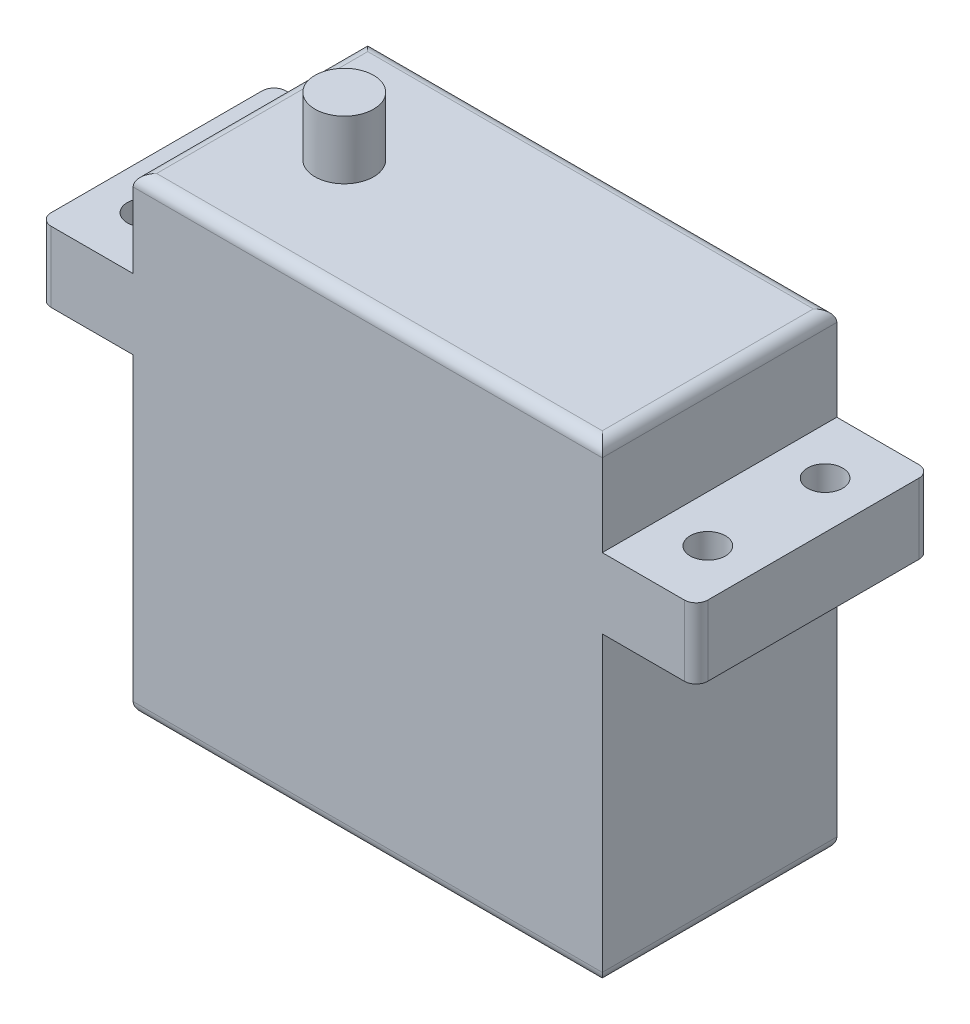
ISO-10303-21;
HEADER;
FILE_DESCRIPTION(('STEP AP214'),'2;1');
FILE_NAME('part.step','',(''),(''),'','','');
FILE_SCHEMA(('AUTOMOTIVE_DESIGN { 1 0 10303 214 1 1 1 1 }'));
ENDSEC;
DATA;
#1=APPLICATION_CONTEXT('core data for automotive mechanical design processes');
#2=APPLICATION_PROTOCOL_DEFINITION('international standard','automotive_design',2000,#1);
#3=PRODUCT_CONTEXT('',#1,'mechanical');
#4=PRODUCT('Part','Part','',(#3));
#5=PRODUCT_RELATED_PRODUCT_CATEGORY('part','',(#4));
#6=PRODUCT_DEFINITION_FORMATION('','',#4);
#7=PRODUCT_DEFINITION_CONTEXT('part definition',#1,'design');
#8=PRODUCT_DEFINITION('design','',#6,#7);
#9=PRODUCT_DEFINITION_SHAPE('','',#8);
#10=(LENGTH_UNIT() NAMED_UNIT(*) SI_UNIT(.MILLI.,.METRE.));
#11=(NAMED_UNIT(*) PLANE_ANGLE_UNIT() SI_UNIT($,.RADIAN.));
#12=(NAMED_UNIT(*) SI_UNIT($,.STERADIAN.) SOLID_ANGLE_UNIT());
#13=UNCERTAINTY_MEASURE_WITH_UNIT(LENGTH_MEASURE(1.E-05),#10,'distance_accuracy_value','');
#14=(GEOMETRIC_REPRESENTATION_CONTEXT(3) GLOBAL_UNCERTAINTY_ASSIGNED_CONTEXT((#13)) GLOBAL_UNIT_ASSIGNED_CONTEXT((#10,
#11,#12)) REPRESENTATION_CONTEXT('',''));
#15=CARTESIAN_POINT('',(0.,0.,0.));
#16=DIRECTION('',(0.,0.,1.));
#17=DIRECTION('',(1.,0.,0.));
#18=AXIS2_PLACEMENT_3D('',#15,#16,#17);
#19=CARTESIAN_POINT('',(-27.,0.,1.));
#20=DIRECTION('',(0.,-1.,0.));
#21=DIRECTION('',(1.,0.,0.));
#22=AXIS2_PLACEMENT_3D('',#19,#20,#21);
#23=CYLINDRICAL_SURFACE('',#22,1.);
#24=DIRECTION('',(0.,1.,0.));
#25=VECTOR('',#24,1.);
#26=CARTESIAN_POINT('',(-27.,0.,0.));
#27=LINE('',#26,#25);
#28=CARTESIAN_POINT('',(-27.,6.60422946958976,0.));
#29=VERTEX_POINT('',#28);
#30=CARTESIAN_POINT('',(-27.,12.6042294695898,0.));
#31=VERTEX_POINT('',#30);
#32=EDGE_CURVE('E324',#29,#31,#27,.T.);
#33=ORIENTED_EDGE('',*,*,#32,.F.);
#34=CARTESIAN_POINT('',(-27.,6.60422946958976,1.));
#35=DIRECTION('',(0.,1.,0.));
#36=DIRECTION('',(-1.,0.,0.));
#37=AXIS2_PLACEMENT_3D('',#34,#35,#36);
#38=CIRCLE('',#37,1.);
#39=CARTESIAN_POINT('',(-28.,6.60422946958976,1.));
#40=VERTEX_POINT('',#39);
#41=EDGE_CURVE('E330',#40,#29,#38,.F.);
#42=ORIENTED_EDGE('',*,*,#41,.F.);
#43=DIRECTION('',(0.,1.,0.));
#44=VECTOR('',#43,1.);
#45=CARTESIAN_POINT('',(-28.,0.,1.));
#46=LINE('',#45,#44);
#47=CARTESIAN_POINT('',(-28.,12.6042294695898,1.));
#48=VERTEX_POINT('',#47);
#49=EDGE_CURVE('E327',#48,#40,#46,.F.);
#50=ORIENTED_EDGE('',*,*,#49,.F.);
#51=CARTESIAN_POINT('',(-27.,12.6042294695898,1.));
#52=DIRECTION('',(0.,-1.,0.));
#53=DIRECTION('',(1.,0.,0.));
#54=AXIS2_PLACEMENT_3D('',#51,#52,#53);
#55=CIRCLE('',#54,1.);
#56=EDGE_CURVE('E332',#31,#48,#55,.F.);
#57=ORIENTED_EDGE('',*,*,#56,.F.);
#58=EDGE_LOOP('',(#33,#42,#50,#57));
#59=FACE_BOUND('',#58,.T.);
#60=ADVANCED_FACE('F42',(#59),#23,.T.);
#61=CARTESIAN_POINT('',(27.,0.,19.));
#62=DIRECTION('',(0.,-1.,0.));
#63=DIRECTION('',(0.,0.,-1.));
#64=AXIS2_PLACEMENT_3D('',#61,#62,#63);
#65=CYLINDRICAL_SURFACE('',#64,1.);
#66=DIRECTION('',(0.,-1.,0.));
#67=VECTOR('',#66,1.);
#68=CARTESIAN_POINT('',(28.,0.,19.));
#69=LINE('',#68,#67);
#70=CARTESIAN_POINT('',(28.,12.,19.));
#71=VERTEX_POINT('',#70);
#72=CARTESIAN_POINT('',(28.,6.,19.));
#73=VERTEX_POINT('',#72);
#74=EDGE_CURVE('E304',#71,#73,#69,.T.);
#75=ORIENTED_EDGE('',*,*,#74,.F.);
#76=CARTESIAN_POINT('',(27.,12.,19.));
#77=DIRECTION('',(0.,-1.,0.));
#78=DIRECTION('',(1.,0.,0.));
#79=AXIS2_PLACEMENT_3D('',#76,#77,#78);
#80=CIRCLE('',#79,1.);
#81=CARTESIAN_POINT('',(27.,12.,20.));
#82=VERTEX_POINT('',#81);
#83=EDGE_CURVE('E319',#82,#71,#80,.F.);
#84=ORIENTED_EDGE('',*,*,#83,.F.);
#85=DIRECTION('',(0.,-1.,0.));
#86=VECTOR('',#85,1.);
#87=CARTESIAN_POINT('',(27.,0.,20.));
#88=LINE('',#87,#86);
#89=CARTESIAN_POINT('',(27.,6.,20.));
#90=VERTEX_POINT('',#89);
#91=EDGE_CURVE('E316',#90,#82,#88,.F.);
#92=ORIENTED_EDGE('',*,*,#91,.F.);
#93=CARTESIAN_POINT('',(27.,6.,19.));
#94=DIRECTION('',(0.,1.,0.));
#95=DIRECTION('',(-1.,0.,0.));
#96=AXIS2_PLACEMENT_3D('',#93,#94,#95);
#97=CIRCLE('',#96,1.);
#98=EDGE_CURVE('E322',#73,#90,#97,.F.);
#99=ORIENTED_EDGE('',*,*,#98,.F.);
#100=EDGE_LOOP('',(#75,#84,#92,#99));
#101=FACE_BOUND('',#100,.T.);
#102=ADVANCED_FACE('F398',(#101),#65,.T.);
#103=CARTESIAN_POINT('',(-20.,20.,20.));
#104=DIRECTION('',(1.,0.,0.));
#105=DIRECTION('',(0.,1.,0.));
#106=AXIS2_PLACEMENT_3D('',#103,#104,#105);
#107=PLANE('',#106);
#108=DIRECTION('',(0.,-1.,0.));
#109=VECTOR('',#108,1.);
#110=CARTESIAN_POINT('',(-20.,20.,20.));
#111=LINE('',#110,#109);
#112=CARTESIAN_POINT('',(-20.,19.,20.));
#113=VERTEX_POINT('',#112);
#114=CARTESIAN_POINT('',(-20.,12.6042294695898,20.));
#115=VERTEX_POINT('',#114);
#116=EDGE_CURVE('E194',#113,#115,#111,.T.);
#117=ORIENTED_EDGE('',*,*,#116,.F.);
#118=DIRECTION('',(0.,0.,-1.));
#119=VECTOR('',#118,1.);
#120=CARTESIAN_POINT('',(-20.,19.,20.));
#121=LINE('',#120,#119);
#122=CARTESIAN_POINT('',(-20.,19.,0.));
#123=VERTEX_POINT('',#122);
#124=EDGE_CURVE('E270',#113,#123,#121,.T.);
#125=ORIENTED_EDGE('',*,*,#124,.T.);
#126=DIRECTION('',(0.,-1.,0.));
#127=VECTOR('',#126,1.);
#128=CARTESIAN_POINT('',(-20.,20.,0.));
#129=LINE('',#128,#127);
#130=CARTESIAN_POINT('',(-20.,12.6042294695898,0.));
#131=VERTEX_POINT('',#130);
#132=EDGE_CURVE('E245',#123,#131,#129,.T.);
#133=ORIENTED_EDGE('',*,*,#132,.T.);
#134=DIRECTION('',(0.,0.,-1.));
#135=VECTOR('',#134,1.);
#136=CARTESIAN_POINT('',(-20.,12.6042294695898,0.));
#137=LINE('',#136,#135);
#138=EDGE_CURVE('E199',#115,#131,#137,.T.);
#139=ORIENTED_EDGE('',*,*,#138,.F.);
#140=EDGE_LOOP('',(#117,#125,#133,#139));
#141=FACE_BOUND('',#140,.T.);
#142=ADVANCED_FACE('F404',(#141),#107,.F.);
#143=CARTESIAN_POINT('',(-20.,6.60422946958976,0.));
#144=VERTEX_POINT('',#143);
#145=CARTESIAN_POINT('',(-20.,-19.,0.));
#146=VERTEX_POINT('',#145);
#147=EDGE_CURVE('E244',#144,#146,#129,.T.);
#148=ORIENTED_EDGE('',*,*,#147,.T.);
#149=DIRECTION('',(0.,0.,-1.));
#150=VECTOR('',#149,1.);
#151=CARTESIAN_POINT('',(-20.,-19.,20.));
#152=LINE('',#151,#150);
#153=CARTESIAN_POINT('',(-20.,-19.,20.));
#154=VERTEX_POINT('',#153);
#155=EDGE_CURVE('E193',#146,#154,#152,.F.);
#156=ORIENTED_EDGE('',*,*,#155,.T.);
#157=CARTESIAN_POINT('',(-20.,6.60422946958976,20.));
#158=VERTEX_POINT('',#157);
#159=EDGE_CURVE('E178',#158,#154,#111,.T.);
#160=ORIENTED_EDGE('',*,*,#159,.F.);
#161=DIRECTION('',(0.,0.,1.));
#162=VECTOR('',#161,1.);
#163=CARTESIAN_POINT('',(-20.,6.60422946958976,0.));
#164=LINE('',#163,#162);
#165=EDGE_CURVE('E190',#144,#158,#164,.T.);
#166=ORIENTED_EDGE('',*,*,#165,.F.);
#167=EDGE_LOOP('',(#148,#156,#160,#166));
#168=FACE_BOUND('',#167,.T.);
#169=ADVANCED_FACE('F189',(#168),#107,.F.);
#170=CARTESIAN_POINT('',(20.,20.,20.));
#171=DIRECTION('',(-1.,0.,0.));
#172=DIRECTION('',(0.,-1.,0.));
#173=AXIS2_PLACEMENT_3D('',#170,#171,#172);
#174=PLANE('',#173);
#175=DIRECTION('',(0.,1.,0.));
#176=VECTOR('',#175,1.);
#177=CARTESIAN_POINT('',(20.,20.,0.));
#178=LINE('',#177,#176);
#179=CARTESIAN_POINT('',(20.,12.,0.));
#180=VERTEX_POINT('',#179);
#181=CARTESIAN_POINT('',(20.,19.,0.));
#182=VERTEX_POINT('',#181);
#183=EDGE_CURVE('E235',#180,#182,#178,.T.);
#184=ORIENTED_EDGE('',*,*,#183,.T.);
#185=DIRECTION('',(0.,0.,-1.));
#186=VECTOR('',#185,1.);
#187=CARTESIAN_POINT('',(20.,19.,20.));
#188=LINE('',#187,#186);
#189=CARTESIAN_POINT('',(20.,19.,20.));
#190=VERTEX_POINT('',#189);
#191=EDGE_CURVE('E267',#182,#190,#188,.F.);
#192=ORIENTED_EDGE('',*,*,#191,.T.);
#193=DIRECTION('',(0.,1.,0.));
#194=VECTOR('',#193,1.);
#195=CARTESIAN_POINT('',(20.,20.,20.));
#196=LINE('',#195,#194);
#197=CARTESIAN_POINT('',(20.,12.,20.));
#198=VERTEX_POINT('',#197);
#199=EDGE_CURVE('E237',#198,#190,#196,.T.);
#200=ORIENTED_EDGE('',*,*,#199,.F.);
#201=DIRECTION('',(0.,0.,1.));
#202=VECTOR('',#201,1.);
#203=CARTESIAN_POINT('',(20.,12.,20.));
#204=LINE('',#203,#202);
#205=EDGE_CURVE('E221',#180,#198,#204,.T.);
#206=ORIENTED_EDGE('',*,*,#205,.F.);
#207=EDGE_LOOP('',(#184,#192,#200,#206));
#208=FACE_BOUND('',#207,.T.);
#209=ADVANCED_FACE('F472',(#208),#174,.F.);
#210=CARTESIAN_POINT('',(20.,-19.,20.));
#211=VERTEX_POINT('',#210);
#212=CARTESIAN_POINT('',(20.,6.,20.));
#213=VERTEX_POINT('',#212);
#214=EDGE_CURVE('E195',#211,#213,#196,.T.);
#215=ORIENTED_EDGE('',*,*,#214,.F.);
#216=DIRECTION('',(0.,0.,-1.));
#217=VECTOR('',#216,1.);
#218=CARTESIAN_POINT('',(20.,-19.,20.));
#219=LINE('',#218,#217);
#220=CARTESIAN_POINT('',(20.,-19.,0.));
#221=VERTEX_POINT('',#220);
#222=EDGE_CURVE('E300',#211,#221,#219,.T.);
#223=ORIENTED_EDGE('',*,*,#222,.T.);
#224=CARTESIAN_POINT('',(20.,6.,0.));
#225=VERTEX_POINT('',#224);
#226=EDGE_CURVE('E241',#221,#225,#178,.T.);
#227=ORIENTED_EDGE('',*,*,#226,.T.);
#228=DIRECTION('',(0.,0.,-1.));
#229=VECTOR('',#228,1.);
#230=CARTESIAN_POINT('',(20.,6.,20.));
#231=LINE('',#230,#229);
#232=EDGE_CURVE('E216',#213,#225,#231,.T.);
#233=ORIENTED_EDGE('',*,*,#232,.F.);
#234=EDGE_LOOP('',(#215,#223,#227,#233));
#235=FACE_BOUND('',#234,.T.);
#236=ADVANCED_FACE('F436',(#235),#174,.F.);
#237=CARTESIAN_POINT('',(-20.,20.,20.));
#238=DIRECTION('',(0.,-1.,0.));
#239=DIRECTION('',(0.,0.,-1.));
#240=AXIS2_PLACEMENT_3D('',#237,#238,#239);
#241=PLANE('',#240);
#242=DIRECTION('',(0.,0.,-1.));
#243=VECTOR('',#242,1.);
#244=CARTESIAN_POINT('',(19.,20.,20.));
#245=LINE('',#244,#243);
#246=CARTESIAN_POINT('',(19.,20.,19.));
#247=VERTEX_POINT('',#246);
#248=CARTESIAN_POINT('',(19.,20.,1.));
#249=VERTEX_POINT('',#248);
#250=EDGE_CURVE('E262',#247,#249,#245,.T.);
#251=ORIENTED_EDGE('',*,*,#250,.T.);
#252=DIRECTION('',(-1.,0.,0.));
#253=VECTOR('',#252,1.);
#254=CARTESIAN_POINT('',(-20.,20.,1.));
#255=LINE('',#254,#253);
#256=CARTESIAN_POINT('',(-19.,20.,1.));
#257=VERTEX_POINT('',#256);
#258=EDGE_CURVE('E265',#249,#257,#255,.T.);
#259=ORIENTED_EDGE('',*,*,#258,.T.);
#260=DIRECTION('',(0.,0.,-1.));
#261=VECTOR('',#260,1.);
#262=CARTESIAN_POINT('',(-19.,20.,20.));
#263=LINE('',#262,#261);
#264=CARTESIAN_POINT('',(-19.,20.,19.));
#265=VERTEX_POINT('',#264);
#266=EDGE_CURVE('E260',#257,#265,#263,.F.);
#267=ORIENTED_EDGE('',*,*,#266,.T.);
#268=DIRECTION('',(-1.,0.,0.));
#269=VECTOR('',#268,1.);
#270=CARTESIAN_POINT('',(20.,20.,19.));
#271=LINE('',#270,#269);
#272=EDGE_CURVE('E250',#265,#247,#271,.F.);
#273=ORIENTED_EDGE('',*,*,#272,.T.);
#274=EDGE_LOOP('',(#251,#259,#267,#273));
#275=FACE_BOUND('',#274,.T.);
#276=CARTESIAN_POINT('',(-12.,20.,10.));
#277=DIRECTION('',(0.,-1.,0.));
#278=DIRECTION('',(0.,0.,-1.));
#279=AXIS2_PLACEMENT_3D('',#276,#277,#278);
#280=CIRCLE('',#279,2.5);
#281=CARTESIAN_POINT('',(-12.,20.,7.5));
#282=VERTEX_POINT('',#281);
#283=EDGE_CURVE('E240',#282,#282,#280,.F.);
#284=ORIENTED_EDGE('',*,*,#283,.F.);
#285=EDGE_LOOP('',(#284));
#286=FACE_BOUND('',#285,.T.);
#287=ADVANCED_FACE('F458',(#275,#286),#241,.F.);
#288=CARTESIAN_POINT('',(-20.,-20.,20.));
#289=DIRECTION('',(0.,1.,0.));
#290=DIRECTION('',(0.,0.,1.));
#291=AXIS2_PLACEMENT_3D('',#288,#289,#290);
#292=PLANE('',#291);
#293=DIRECTION('',(1.,0.,0.));
#294=VECTOR('',#293,1.);
#295=CARTESIAN_POINT('',(-20.,-20.,19.));
#296=LINE('',#295,#294);
#297=CARTESIAN_POINT('',(19.,-20.,19.));
#298=VERTEX_POINT('',#297);
#299=CARTESIAN_POINT('',(-19.,-20.,19.));
#300=VERTEX_POINT('',#299);
#301=EDGE_CURVE('E292',#298,#300,#296,.F.);
#302=ORIENTED_EDGE('',*,*,#301,.T.);
#303=DIRECTION('',(0.,0.,-1.));
#304=VECTOR('',#303,1.);
#305=CARTESIAN_POINT('',(-19.,-20.,20.));
#306=LINE('',#305,#304);
#307=CARTESIAN_POINT('',(-19.,-20.,1.));
#308=VERTEX_POINT('',#307);
#309=EDGE_CURVE('E294',#300,#308,#306,.T.);
#310=ORIENTED_EDGE('',*,*,#309,.T.);
#311=DIRECTION('',(1.,0.,0.));
#312=VECTOR('',#311,1.);
#313=CARTESIAN_POINT('',(-20.,-20.,1.));
#314=LINE('',#313,#312);
#315=CARTESIAN_POINT('',(19.,-20.,1.));
#316=VERTEX_POINT('',#315);
#317=EDGE_CURVE('E276',#308,#316,#314,.T.);
#318=ORIENTED_EDGE('',*,*,#317,.T.);
#319=DIRECTION('',(0.,0.,-1.));
#320=VECTOR('',#319,1.);
#321=CARTESIAN_POINT('',(19.,-20.,20.));
#322=LINE('',#321,#320);
#323=EDGE_CURVE('E290',#316,#298,#322,.F.);
#324=ORIENTED_EDGE('',*,*,#323,.T.);
#325=EDGE_LOOP('',(#302,#310,#318,#324));
#326=FACE_BOUND('',#325,.T.);
#327=ADVANCED_FACE('F456',(#326),#292,.F.);
#328=CARTESIAN_POINT('',(0.,0.,20.));
#329=DIRECTION('',(0.,0.,1.));
#330=DIRECTION('',(1.,0.,0.));
#331=AXIS2_PLACEMENT_3D('',#328,#329,#330);
#332=PLANE('',#331);
#333=DIRECTION('',(1.,0.,0.));
#334=VECTOR('',#333,1.);
#335=CARTESIAN_POINT('',(-28.,12.6042294695898,20.));
#336=LINE('',#335,#334);
#337=CARTESIAN_POINT('',(-27.,12.6042294695898,20.));
#338=VERTEX_POINT('',#337);
#339=EDGE_CURVE('E183',#338,#115,#336,.T.);
#340=ORIENTED_EDGE('',*,*,#339,.F.);
#341=DIRECTION('',(0.,1.,0.));
#342=VECTOR('',#341,1.);
#343=CARTESIAN_POINT('',(-27.,0.,20.));
#344=LINE('',#343,#342);
#345=CARTESIAN_POINT('',(-27.,6.60422946958976,20.));
#346=VERTEX_POINT('',#345);
#347=EDGE_CURVE('E50',#338,#346,#344,.F.);
#348=ORIENTED_EDGE('',*,*,#347,.T.);
#349=DIRECTION('',(1.,0.,0.));
#350=VECTOR('',#349,1.);
#351=CARTESIAN_POINT('',(-28.,6.60422946958976,20.));
#352=LINE('',#351,#350);
#353=EDGE_CURVE('E175',#346,#158,#352,.T.);
#354=ORIENTED_EDGE('',*,*,#353,.T.);
#355=ORIENTED_EDGE('',*,*,#159,.T.);
#356=DIRECTION('',(1.,0.,0.));
#357=VECTOR('',#356,1.);
#358=CARTESIAN_POINT('',(20.,-19.,20.));
#359=LINE('',#358,#357);
#360=EDGE_CURVE('E298',#154,#211,#359,.T.);
#361=ORIENTED_EDGE('',*,*,#360,.T.);
#362=ORIENTED_EDGE('',*,*,#214,.T.);
#363=DIRECTION('',(-1.,0.,0.));
#364=VECTOR('',#363,1.);
#365=CARTESIAN_POINT('',(28.,6.,20.));
#366=LINE('',#365,#364);
#367=EDGE_CURVE('E233',#90,#213,#366,.T.);
#368=ORIENTED_EDGE('',*,*,#367,.F.);
#369=ORIENTED_EDGE('',*,*,#91,.T.);
#370=DIRECTION('',(-1.,0.,0.));
#371=VECTOR('',#370,1.);
#372=CARTESIAN_POINT('',(28.,12.,20.));
#373=LINE('',#372,#371);
#374=EDGE_CURVE('E223',#82,#198,#373,.T.);
#375=ORIENTED_EDGE('',*,*,#374,.T.);
#376=ORIENTED_EDGE('',*,*,#199,.T.);
#377=DIRECTION('',(-1.,0.,0.));
#378=VECTOR('',#377,1.);
#379=CARTESIAN_POINT('',(-20.,19.,20.));
#380=LINE('',#379,#378);
#381=EDGE_CURVE('E274',#190,#113,#380,.T.);
#382=ORIENTED_EDGE('',*,*,#381,.T.);
#383=ORIENTED_EDGE('',*,*,#116,.T.);
#384=EDGE_LOOP('',(#340,#348,#354,#355,#361,#362,#368,#369,#375,#376,#382,#383));
#385=FACE_BOUND('',#384,.T.);
#386=ADVANCED_FACE('F177',(#385),#332,.T.);
#387=CARTESIAN_POINT('',(0.,0.,0.));
#388=DIRECTION('',(0.,0.,1.));
#389=DIRECTION('',(1.,0.,0.));
#390=AXIS2_PLACEMENT_3D('',#387,#388,#389);
#391=PLANE('',#390);
#392=DIRECTION('',(-1.,0.,0.));
#393=VECTOR('',#392,1.);
#394=CARTESIAN_POINT('',(28.,12.,0.));
#395=LINE('',#394,#393);
#396=CARTESIAN_POINT('',(27.,12.,0.));
#397=VERTEX_POINT('',#396);
#398=EDGE_CURVE('E229',#397,#180,#395,.T.);
#399=ORIENTED_EDGE('',*,*,#398,.F.);
#400=DIRECTION('',(0.,1.,0.));
#401=VECTOR('',#400,1.);
#402=CARTESIAN_POINT('',(27.,6.,0.));
#403=LINE('',#402,#401);
#404=CARTESIAN_POINT('',(27.,6.,0.));
#405=VERTEX_POINT('',#404);
#406=EDGE_CURVE('E340',#397,#405,#403,.F.);
#407=ORIENTED_EDGE('',*,*,#406,.T.);
#408=DIRECTION('',(-1.,0.,0.));
#409=VECTOR('',#408,1.);
#410=CARTESIAN_POINT('',(28.,6.,0.));
#411=LINE('',#410,#409);
#412=EDGE_CURVE('E231',#405,#225,#411,.T.);
#413=ORIENTED_EDGE('',*,*,#412,.T.);
#414=ORIENTED_EDGE('',*,*,#226,.F.);
#415=DIRECTION('',(1.,0.,0.));
#416=VECTOR('',#415,1.);
#417=CARTESIAN_POINT('',(0.,-19.,0.));
#418=LINE('',#417,#416);
#419=EDGE_CURVE('E302',#221,#146,#418,.F.);
#420=ORIENTED_EDGE('',*,*,#419,.T.);
#421=ORIENTED_EDGE('',*,*,#147,.F.);
#422=DIRECTION('',(1.,0.,0.));
#423=VECTOR('',#422,1.);
#424=CARTESIAN_POINT('',(-28.,6.60422946958976,0.));
#425=LINE('',#424,#423);
#426=EDGE_CURVE('E182',#29,#144,#425,.T.);
#427=ORIENTED_EDGE('',*,*,#426,.F.);
#428=ORIENTED_EDGE('',*,*,#32,.T.);
#429=DIRECTION('',(1.,0.,0.));
#430=VECTOR('',#429,1.);
#431=CARTESIAN_POINT('',(-28.,12.6042294695898,0.));
#432=LINE('',#431,#430);
#433=EDGE_CURVE('E212',#31,#131,#432,.T.);
#434=ORIENTED_EDGE('',*,*,#433,.T.);
#435=ORIENTED_EDGE('',*,*,#132,.F.);
#436=DIRECTION('',(-1.,0.,0.));
#437=VECTOR('',#436,1.);
#438=CARTESIAN_POINT('',(0.,19.,0.));
#439=LINE('',#438,#437);
#440=EDGE_CURVE('E272',#123,#182,#439,.F.);
#441=ORIENTED_EDGE('',*,*,#440,.T.);
#442=ORIENTED_EDGE('',*,*,#183,.F.);
#443=EDGE_LOOP('',(#399,#407,#413,#414,#420,#421,#427,#428,#434,#435,#441,#442));
#444=FACE_BOUND('',#443,.T.);
#445=ADVANCED_FACE('F441',(#444),#391,.F.);
#446=CARTESIAN_POINT('',(28.,6.,20.));
#447=DIRECTION('',(0.,1.,0.));
#448=DIRECTION('',(-1.,0.,0.));
#449=AXIS2_PLACEMENT_3D('',#446,#447,#448);
#450=PLANE('',#449);
#451=CARTESIAN_POINT('',(24.,6.,5.00000000000001));
#452=DIRECTION('',(0.,1.,0.));
#453=DIRECTION('',(-1.,0.,0.));
#454=AXIS2_PLACEMENT_3D('',#451,#452,#453);
#455=CIRCLE('',#454,1.5);
#456=CARTESIAN_POINT('',(22.5,6.,5.00000000000001));
#457=VERTEX_POINT('',#456);
#458=EDGE_CURVE('E206',#457,#457,#455,.T.);
#459=ORIENTED_EDGE('',*,*,#458,.T.);
#460=EDGE_LOOP('',(#459));
#461=FACE_BOUND('',#460,.T.);
#462=CARTESIAN_POINT('',(24.,6.,15.));
#463=DIRECTION('',(0.,1.,0.));
#464=DIRECTION('',(-1.,0.,0.));
#465=AXIS2_PLACEMENT_3D('',#462,#463,#464);
#466=CIRCLE('',#465,1.5);
#467=CARTESIAN_POINT('',(22.5,6.,15.));
#468=VERTEX_POINT('',#467);
#469=EDGE_CURVE('E254',#468,#468,#466,.T.);
#470=ORIENTED_EDGE('',*,*,#469,.T.);
#471=EDGE_LOOP('',(#470));
#472=FACE_BOUND('',#471,.T.);
#473=ORIENTED_EDGE('',*,*,#412,.F.);
#474=CARTESIAN_POINT('',(27.,6.,1.));
#475=DIRECTION('',(0.,1.,0.));
#476=DIRECTION('',(-1.,0.,0.));
#477=AXIS2_PLACEMENT_3D('',#474,#475,#476);
#478=CIRCLE('',#477,1.);
#479=CARTESIAN_POINT('',(28.,6.,1.));
#480=VERTEX_POINT('',#479);
#481=EDGE_CURVE('E342',#405,#480,#478,.F.);
#482=ORIENTED_EDGE('',*,*,#481,.T.);
#483=DIRECTION('',(0.,0.,-1.));
#484=VECTOR('',#483,1.);
#485=CARTESIAN_POINT('',(28.,6.,20.));
#486=LINE('',#485,#484);
#487=EDGE_CURVE('E217',#73,#480,#486,.T.);
#488=ORIENTED_EDGE('',*,*,#487,.F.);
#489=ORIENTED_EDGE('',*,*,#98,.T.);
#490=ORIENTED_EDGE('',*,*,#367,.T.);
#491=ORIENTED_EDGE('',*,*,#232,.T.);
#492=EDGE_LOOP('',(#473,#482,#488,#489,#490,#491));
#493=FACE_BOUND('',#492,.T.);
#494=ADVANCED_FACE('F426',(#461,#472,#493),#450,.F.);
#495=CARTESIAN_POINT('',(28.,12.,20.));
#496=DIRECTION('',(0.,-1.,0.));
#497=DIRECTION('',(1.,0.,0.));
#498=AXIS2_PLACEMENT_3D('',#495,#496,#497);
#499=PLANE('',#498);
#500=CARTESIAN_POINT('',(24.,12.,5.00000000000001));
#501=DIRECTION('',(0.,-1.,0.));
#502=DIRECTION('',(1.,0.,0.));
#503=AXIS2_PLACEMENT_3D('',#500,#501,#502);
#504=CIRCLE('',#503,1.5);
#505=CARTESIAN_POINT('',(25.5,12.,5.00000000000001));
#506=VERTEX_POINT('',#505);
#507=EDGE_CURVE('E256',#506,#506,#504,.T.);
#508=ORIENTED_EDGE('',*,*,#507,.T.);
#509=EDGE_LOOP('',(#508));
#510=FACE_BOUND('',#509,.T.);
#511=CARTESIAN_POINT('',(24.,12.,15.));
#512=DIRECTION('',(0.,-1.,0.));
#513=DIRECTION('',(1.,0.,0.));
#514=AXIS2_PLACEMENT_3D('',#511,#512,#513);
#515=CIRCLE('',#514,1.5);
#516=CARTESIAN_POINT('',(25.5,12.,15.));
#517=VERTEX_POINT('',#516);
#518=EDGE_CURVE('E251',#517,#517,#515,.T.);
#519=ORIENTED_EDGE('',*,*,#518,.T.);
#520=EDGE_LOOP('',(#519));
#521=FACE_BOUND('',#520,.T.);
#522=DIRECTION('',(0.,0.,1.));
#523=VECTOR('',#522,1.);
#524=CARTESIAN_POINT('',(28.,12.,20.));
#525=LINE('',#524,#523);
#526=CARTESIAN_POINT('',(28.,12.,1.));
#527=VERTEX_POINT('',#526);
#528=EDGE_CURVE('E220',#527,#71,#525,.T.);
#529=ORIENTED_EDGE('',*,*,#528,.F.);
#530=CARTESIAN_POINT('',(27.,12.,1.));
#531=DIRECTION('',(0.,-1.,0.));
#532=DIRECTION('',(1.,0.,0.));
#533=AXIS2_PLACEMENT_3D('',#530,#531,#532);
#534=CIRCLE('',#533,1.);
#535=EDGE_CURVE('E338',#527,#397,#534,.F.);
#536=ORIENTED_EDGE('',*,*,#535,.T.);
#537=ORIENTED_EDGE('',*,*,#398,.T.);
#538=ORIENTED_EDGE('',*,*,#205,.T.);
#539=ORIENTED_EDGE('',*,*,#374,.F.);
#540=ORIENTED_EDGE('',*,*,#83,.T.);
#541=EDGE_LOOP('',(#529,#536,#537,#538,#539,#540));
#542=FACE_BOUND('',#541,.T.);
#543=ADVANCED_FACE('F394',(#510,#521,#542),#499,.F.);
#544=CARTESIAN_POINT('',(28.,0.,0.));
#545=DIRECTION('',(1.,0.,0.));
#546=DIRECTION('',(0.,0.,-1.));
#547=AXIS2_PLACEMENT_3D('',#544,#545,#546);
#548=PLANE('',#547);
#549=ORIENTED_EDGE('',*,*,#487,.T.);
#550=DIRECTION('',(0.,1.,0.));
#551=VECTOR('',#550,1.);
#552=CARTESIAN_POINT('',(28.,12.,1.));
#553=LINE('',#552,#551);
#554=EDGE_CURVE('E335',#480,#527,#553,.T.);
#555=ORIENTED_EDGE('',*,*,#554,.T.);
#556=ORIENTED_EDGE('',*,*,#528,.T.);
#557=ORIENTED_EDGE('',*,*,#74,.T.);
#558=EDGE_LOOP('',(#549,#555,#556,#557));
#559=FACE_BOUND('',#558,.T.);
#560=ADVANCED_FACE('F388',(#559),#548,.T.);
#561=CARTESIAN_POINT('',(-28.,6.60422946958976,0.));
#562=DIRECTION('',(0.,1.,0.));
#563=DIRECTION('',(-1.,0.,0.));
#564=AXIS2_PLACEMENT_3D('',#561,#562,#563);
#565=PLANE('',#564);
#566=CARTESIAN_POINT('',(-24.,6.60422946958976,15.));
#567=DIRECTION('',(0.,1.,0.));
#568=DIRECTION('',(-1.,0.,0.));
#569=AXIS2_PLACEMENT_3D('',#566,#567,#568);
#570=CIRCLE('',#569,1.5);
#571=CARTESIAN_POINT('',(-25.5,6.60422946958976,15.));
#572=VERTEX_POINT('',#571);
#573=EDGE_CURVE('E255',#572,#572,#570,.T.);
#574=ORIENTED_EDGE('',*,*,#573,.T.);
#575=EDGE_LOOP('',(#574));
#576=FACE_BOUND('',#575,.T.);
#577=CARTESIAN_POINT('',(-24.,6.60422946958976,5.));
#578=DIRECTION('',(0.,1.,0.));
#579=DIRECTION('',(-1.,0.,0.));
#580=AXIS2_PLACEMENT_3D('',#577,#578,#579);
#581=CIRCLE('',#580,1.5);
#582=CARTESIAN_POINT('',(-25.5,6.60422946958976,5.));
#583=VERTEX_POINT('',#582);
#584=EDGE_CURVE('E363',#583,#583,#581,.T.);
#585=ORIENTED_EDGE('',*,*,#584,.T.);
#586=EDGE_LOOP('',(#585));
#587=FACE_BOUND('',#586,.T.);
#588=ORIENTED_EDGE('',*,*,#353,.F.);
#589=CARTESIAN_POINT('',(-27.,6.60422946958976,19.));
#590=DIRECTION('',(0.,1.,0.));
#591=DIRECTION('',(-1.,0.,0.));
#592=AXIS2_PLACEMENT_3D('',#589,#590,#591);
#593=CIRCLE('',#592,1.);
#594=CARTESIAN_POINT('',(-28.,6.60422946958976,19.));
#595=VERTEX_POINT('',#594);
#596=EDGE_CURVE('E11',#346,#595,#593,.F.);
#597=ORIENTED_EDGE('',*,*,#596,.T.);
#598=DIRECTION('',(0.,0.,1.));
#599=VECTOR('',#598,1.);
#600=CARTESIAN_POINT('',(-28.,6.60422946958976,0.));
#601=LINE('',#600,#599);
#602=EDGE_CURVE('E203',#40,#595,#601,.T.);
#603=ORIENTED_EDGE('',*,*,#602,.F.);
#604=ORIENTED_EDGE('',*,*,#41,.T.);
#605=ORIENTED_EDGE('',*,*,#426,.T.);
#606=ORIENTED_EDGE('',*,*,#165,.T.);
#607=EDGE_LOOP('',(#588,#597,#603,#604,#605,#606));
#608=FACE_BOUND('',#607,.T.);
#609=ADVANCED_FACE('F197',(#576,#587,#608),#565,.F.);
#610=CARTESIAN_POINT('',(-28.,12.6042294695898,0.));
#611=DIRECTION('',(0.,-1.,0.));
#612=DIRECTION('',(1.,0.,0.));
#613=AXIS2_PLACEMENT_3D('',#610,#611,#612);
#614=PLANE('',#613);
#615=CARTESIAN_POINT('',(-24.,12.6042294695898,15.));
#616=DIRECTION('',(0.,1.,0.));
#617=DIRECTION('',(-1.,0.,0.));
#618=AXIS2_PLACEMENT_3D('',#615,#616,#617);
#619=CIRCLE('',#618,1.5);
#620=CARTESIAN_POINT('',(-25.5,12.6042294695898,15.));
#621=VERTEX_POINT('',#620);
#622=EDGE_CURVE('E288',#621,#621,#619,.T.);
#623=ORIENTED_EDGE('',*,*,#622,.F.);
#624=EDGE_LOOP('',(#623));
#625=FACE_BOUND('',#624,.T.);
#626=CARTESIAN_POINT('',(-24.,12.6042294695898,5.));
#627=DIRECTION('',(0.,1.,0.));
#628=DIRECTION('',(-1.,0.,0.));
#629=AXIS2_PLACEMENT_3D('',#626,#627,#628);
#630=CIRCLE('',#629,1.5);
#631=CARTESIAN_POINT('',(-25.5,12.6042294695898,5.));
#632=VERTEX_POINT('',#631);
#633=EDGE_CURVE('E366',#632,#632,#630,.T.);
#634=ORIENTED_EDGE('',*,*,#633,.F.);
#635=EDGE_LOOP('',(#634));
#636=FACE_BOUND('',#635,.T.);
#637=DIRECTION('',(0.,0.,-1.));
#638=VECTOR('',#637,1.);
#639=CARTESIAN_POINT('',(-28.,12.6042294695898,0.));
#640=LINE('',#639,#638);
#641=CARTESIAN_POINT('',(-28.,12.6042294695898,19.));
#642=VERTEX_POINT('',#641);
#643=EDGE_CURVE('E209',#642,#48,#640,.T.);
#644=ORIENTED_EDGE('',*,*,#643,.F.);
#645=CARTESIAN_POINT('',(-27.,12.6042294695898,19.));
#646=DIRECTION('',(0.,-1.,0.));
#647=DIRECTION('',(1.,0.,0.));
#648=AXIS2_PLACEMENT_3D('',#645,#646,#647);
#649=CIRCLE('',#648,1.);
#650=EDGE_CURVE('E64',#642,#338,#649,.F.);
#651=ORIENTED_EDGE('',*,*,#650,.T.);
#652=ORIENTED_EDGE('',*,*,#339,.T.);
#653=ORIENTED_EDGE('',*,*,#138,.T.);
#654=ORIENTED_EDGE('',*,*,#433,.F.);
#655=ORIENTED_EDGE('',*,*,#56,.T.);
#656=EDGE_LOOP('',(#644,#651,#652,#653,#654,#655));
#657=FACE_BOUND('',#656,.T.);
#658=ADVANCED_FACE('F353',(#625,#636,#657),#614,.F.);
#659=CARTESIAN_POINT('',(-28.,0.,0.));
#660=DIRECTION('',(-1.,0.,0.));
#661=DIRECTION('',(0.,-1.,0.));
#662=AXIS2_PLACEMENT_3D('',#659,#660,#661);
#663=PLANE('',#662);
#664=ORIENTED_EDGE('',*,*,#602,.T.);
#665=DIRECTION('',(0.,1.,0.));
#666=VECTOR('',#665,1.);
#667=CARTESIAN_POINT('',(-28.,0.,19.));
#668=LINE('',#667,#666);
#669=EDGE_CURVE('E344',#595,#642,#668,.T.);
#670=ORIENTED_EDGE('',*,*,#669,.T.);
#671=ORIENTED_EDGE('',*,*,#643,.T.);
#672=ORIENTED_EDGE('',*,*,#49,.T.);
#673=EDGE_LOOP('',(#664,#670,#671,#672));
#674=FACE_BOUND('',#673,.T.);
#675=ADVANCED_FACE('F350',(#674),#663,.T.);
#676=CARTESIAN_POINT('',(-12.,25.,10.));
#677=DIRECTION('',(0.,-1.,0.));
#678=DIRECTION('',(0.,0.,-1.));
#679=AXIS2_PLACEMENT_3D('',#676,#677,#678);
#680=CYLINDRICAL_SURFACE('',#679,2.5);
#681=CARTESIAN_POINT('',(-12.,25.,10.));
#682=DIRECTION('',(0.,1.,0.));
#683=DIRECTION('',(0.,0.,1.));
#684=AXIS2_PLACEMENT_3D('',#681,#682,#683);
#685=CIRCLE('',#684,2.5);
#686=CARTESIAN_POINT('',(-12.,25.,12.5));
#687=VERTEX_POINT('',#686);
#688=EDGE_CURVE('E200',#687,#687,#685,.T.);
#689=ORIENTED_EDGE('',*,*,#688,.F.);
#690=EDGE_LOOP('',(#689));
#691=FACE_BOUND('',#690,.T.);
#692=ORIENTED_EDGE('',*,*,#283,.T.);
#693=EDGE_LOOP('',(#692));
#694=FACE_BOUND('',#693,.T.);
#695=ADVANCED_FACE('F657',(#691,#694),#680,.T.);
#696=CARTESIAN_POINT('',(-12.,25.,10.));
#697=DIRECTION('',(0.,1.,0.));
#698=DIRECTION('',(0.,0.,1.));
#699=AXIS2_PLACEMENT_3D('',#696,#697,#698);
#700=PLANE('',#699);
#701=ORIENTED_EDGE('',*,*,#688,.T.);
#702=EDGE_LOOP('',(#701));
#703=FACE_BOUND('',#702,.T.);
#704=ADVANCED_FACE('F383',(#703),#700,.T.);
#705=CARTESIAN_POINT('',(-24.,-2.39577053041024,5.));
#706=DIRECTION('',(0.,1.,0.));
#707=DIRECTION('',(-1.,0.,0.));
#708=AXIS2_PLACEMENT_3D('',#705,#706,#707);
#709=CYLINDRICAL_SURFACE('',#708,1.5);
#710=ORIENTED_EDGE('',*,*,#633,.T.);
#711=EDGE_LOOP('',(#710));
#712=FACE_BOUND('',#711,.T.);
#713=ORIENTED_EDGE('',*,*,#584,.F.);
#714=EDGE_LOOP('',(#713));
#715=FACE_BOUND('',#714,.T.);
#716=ADVANCED_FACE('F380',(#712,#715),#709,.F.);
#717=CARTESIAN_POINT('',(-24.,-2.39577053041024,15.));
#718=DIRECTION('',(0.,1.,0.));
#719=DIRECTION('',(-1.,0.,0.));
#720=AXIS2_PLACEMENT_3D('',#717,#718,#719);
#721=CYLINDRICAL_SURFACE('',#720,1.5);
#722=ORIENTED_EDGE('',*,*,#622,.T.);
#723=EDGE_LOOP('',(#722));
#724=FACE_BOUND('',#723,.T.);
#725=ORIENTED_EDGE('',*,*,#573,.F.);
#726=EDGE_LOOP('',(#725));
#727=FACE_BOUND('',#726,.T.);
#728=ADVANCED_FACE('F372',(#724,#727),#721,.F.);
#729=CARTESIAN_POINT('',(24.,-2.39577053041023,15.));
#730=DIRECTION('',(0.,1.,0.));
#731=DIRECTION('',(-1.,0.,0.));
#732=AXIS2_PLACEMENT_3D('',#729,#730,#731);
#733=CYLINDRICAL_SURFACE('',#732,1.5);
#734=ORIENTED_EDGE('',*,*,#518,.F.);
#735=EDGE_LOOP('',(#734));
#736=FACE_BOUND('',#735,.T.);
#737=ORIENTED_EDGE('',*,*,#469,.F.);
#738=EDGE_LOOP('',(#737));
#739=FACE_BOUND('',#738,.T.);
#740=ADVANCED_FACE('F615',(#736,#739),#733,.F.);
#741=CARTESIAN_POINT('',(24.,-2.39577053041023,5.00000000000001));
#742=DIRECTION('',(0.,1.,0.));
#743=DIRECTION('',(-1.,0.,0.));
#744=AXIS2_PLACEMENT_3D('',#741,#742,#743);
#745=CYLINDRICAL_SURFACE('',#744,1.5);
#746=ORIENTED_EDGE('',*,*,#507,.F.);
#747=EDGE_LOOP('',(#746));
#748=FACE_BOUND('',#747,.T.);
#749=ORIENTED_EDGE('',*,*,#458,.F.);
#750=EDGE_LOOP('',(#749));
#751=FACE_BOUND('',#750,.T.);
#752=ADVANCED_FACE('F490',(#748,#751),#745,.F.);
#753=CARTESIAN_POINT('',(-19.,19.,20.));
#754=DIRECTION('',(0.,0.,-1.));
#755=DIRECTION('',(-1.,0.,0.));
#756=AXIS2_PLACEMENT_3D('',#753,#754,#755);
#757=CYLINDRICAL_SURFACE('',#756,1.);
#758=CARTESIAN_POINT('',(-19.,19.,1.));
#759=DIRECTION('',(-0.707106781186547,0.,0.707106781186547));
#760=DIRECTION('',(-0.707106781186547,0.,-0.707106781186547));
#761=AXIS2_PLACEMENT_3D('',#758,#759,#760);
#762=ELLIPSE('',#761,1.41421356237309,1.);
#763=EDGE_CURVE('E282',#123,#257,#762,.F.);
#764=ORIENTED_EDGE('',*,*,#763,.F.);
#765=ORIENTED_EDGE('',*,*,#124,.F.);
#766=CARTESIAN_POINT('',(-19.,19.,19.));
#767=DIRECTION('',(0.707106781186547,0.,0.707106781186547));
#768=DIRECTION('',(0.707106781186547,0.,-0.707106781186547));
#769=AXIS2_PLACEMENT_3D('',#766,#767,#768);
#770=ELLIPSE('',#769,1.41421356237309,1.);
#771=EDGE_CURVE('E285',#265,#113,#770,.T.);
#772=ORIENTED_EDGE('',*,*,#771,.F.);
#773=ORIENTED_EDGE('',*,*,#266,.F.);
#774=EDGE_LOOP('',(#764,#765,#772,#773));
#775=FACE_BOUND('',#774,.T.);
#776=ADVANCED_FACE('F487',(#775),#757,.T.);
#777=CARTESIAN_POINT('',(0.,19.,19.));
#778=DIRECTION('',(1.,0.,0.));
#779=DIRECTION('',(0.,0.,-1.));
#780=AXIS2_PLACEMENT_3D('',#777,#778,#779);
#781=CYLINDRICAL_SURFACE('',#780,1.);
#782=ORIENTED_EDGE('',*,*,#771,.T.);
#783=ORIENTED_EDGE('',*,*,#381,.F.);
#784=CARTESIAN_POINT('',(19.,19.,19.));
#785=DIRECTION('',(0.707106781186547,0.,-0.707106781186547));
#786=DIRECTION('',(0.707106781186547,0.,0.707106781186547));
#787=AXIS2_PLACEMENT_3D('',#784,#785,#786);
#788=ELLIPSE('',#787,1.41421356237309,1.);
#789=EDGE_CURVE('E279',#247,#190,#788,.T.);
#790=ORIENTED_EDGE('',*,*,#789,.F.);
#791=ORIENTED_EDGE('',*,*,#272,.F.);
#792=EDGE_LOOP('',(#782,#783,#790,#791));
#793=FACE_BOUND('',#792,.T.);
#794=ADVANCED_FACE('F483',(#793),#781,.T.);
#795=CARTESIAN_POINT('',(-20.,19.,1.));
#796=DIRECTION('',(-1.,0.,0.));
#797=DIRECTION('',(0.,0.,1.));
#798=AXIS2_PLACEMENT_3D('',#795,#796,#797);
#799=CYLINDRICAL_SURFACE('',#798,1.);
#800=ORIENTED_EDGE('',*,*,#763,.T.);
#801=ORIENTED_EDGE('',*,*,#258,.F.);
#802=CARTESIAN_POINT('',(19.,19.,1.));
#803=DIRECTION('',(-0.707106781186547,0.,-0.707106781186547));
#804=DIRECTION('',(-0.707106781186547,0.,0.707106781186547));
#805=AXIS2_PLACEMENT_3D('',#802,#803,#804);
#806=ELLIPSE('',#805,1.41421356237309,1.);
#807=EDGE_CURVE('E277',#182,#249,#806,.F.);
#808=ORIENTED_EDGE('',*,*,#807,.F.);
#809=ORIENTED_EDGE('',*,*,#440,.F.);
#810=EDGE_LOOP('',(#800,#801,#808,#809));
#811=FACE_BOUND('',#810,.T.);
#812=ADVANCED_FACE('F479',(#811),#799,.T.);
#813=CARTESIAN_POINT('',(19.,19.,20.));
#814=DIRECTION('',(0.,0.,-1.));
#815=DIRECTION('',(-1.,0.,0.));
#816=AXIS2_PLACEMENT_3D('',#813,#814,#815);
#817=CYLINDRICAL_SURFACE('',#816,1.);
#818=ORIENTED_EDGE('',*,*,#789,.T.);
#819=ORIENTED_EDGE('',*,*,#191,.F.);
#820=ORIENTED_EDGE('',*,*,#807,.T.);
#821=ORIENTED_EDGE('',*,*,#250,.F.);
#822=EDGE_LOOP('',(#818,#819,#820,#821));
#823=FACE_BOUND('',#822,.T.);
#824=ADVANCED_FACE('F476',(#823),#817,.T.);
#825=CARTESIAN_POINT('',(19.,-19.,20.));
#826=DIRECTION('',(0.,0.,-1.));
#827=DIRECTION('',(-1.,0.,0.));
#828=AXIS2_PLACEMENT_3D('',#825,#826,#827);
#829=CYLINDRICAL_SURFACE('',#828,1.);
#830=CARTESIAN_POINT('',(19.,-19.,1.));
#831=DIRECTION('',(0.707106781186547,0.,0.707106781186547));
#832=DIRECTION('',(0.707106781186547,0.,-0.707106781186547));
#833=AXIS2_PLACEMENT_3D('',#830,#831,#832);
#834=ELLIPSE('',#833,1.41421356237309,1.);
#835=EDGE_CURVE('E309',#221,#316,#834,.F.);
#836=ORIENTED_EDGE('',*,*,#835,.F.);
#837=ORIENTED_EDGE('',*,*,#222,.F.);
#838=CARTESIAN_POINT('',(19.,-19.,19.));
#839=DIRECTION('',(0.707106781186547,0.,-0.707106781186547));
#840=DIRECTION('',(-0.707106781186547,0.,-0.707106781186547));
#841=AXIS2_PLACEMENT_3D('',#838,#839,#840);
#842=ELLIPSE('',#841,1.41421356237309,1.);
#843=EDGE_CURVE('E280',#298,#211,#842,.F.);
#844=ORIENTED_EDGE('',*,*,#843,.F.);
#845=ORIENTED_EDGE('',*,*,#323,.F.);
#846=EDGE_LOOP('',(#836,#837,#844,#845));
#847=FACE_BOUND('',#846,.T.);
#848=ADVANCED_FACE('F445',(#847),#829,.T.);
#849=CARTESIAN_POINT('',(0.,-19.,19.));
#850=DIRECTION('',(-1.,0.,0.));
#851=DIRECTION('',(0.,0.,1.));
#852=AXIS2_PLACEMENT_3D('',#849,#850,#851);
#853=CYLINDRICAL_SURFACE('',#852,1.);
#854=ORIENTED_EDGE('',*,*,#843,.T.);
#855=ORIENTED_EDGE('',*,*,#360,.F.);
#856=CARTESIAN_POINT('',(-19.,-19.,19.));
#857=DIRECTION('',(-0.707106781186547,0.,-0.707106781186547));
#858=DIRECTION('',(-0.707106781186547,0.,0.707106781186547));
#859=AXIS2_PLACEMENT_3D('',#856,#857,#858);
#860=ELLIPSE('',#859,1.41421356237309,1.);
#861=EDGE_CURVE('E307',#300,#154,#860,.T.);
#862=ORIENTED_EDGE('',*,*,#861,.F.);
#863=ORIENTED_EDGE('',*,*,#301,.F.);
#864=EDGE_LOOP('',(#854,#855,#862,#863));
#865=FACE_BOUND('',#864,.T.);
#866=ADVANCED_FACE('F454',(#865),#853,.T.);
#867=CARTESIAN_POINT('',(-20.,-19.,1.));
#868=DIRECTION('',(1.,0.,0.));
#869=DIRECTION('',(0.,0.,-1.));
#870=AXIS2_PLACEMENT_3D('',#867,#868,#869);
#871=CYLINDRICAL_SURFACE('',#870,1.);
#872=ORIENTED_EDGE('',*,*,#835,.T.);
#873=ORIENTED_EDGE('',*,*,#317,.F.);
#874=CARTESIAN_POINT('',(-19.,-19.,1.));
#875=DIRECTION('',(0.707106781186547,0.,-0.707106781186547));
#876=DIRECTION('',(0.707106781186547,0.,0.707106781186547));
#877=AXIS2_PLACEMENT_3D('',#874,#875,#876);
#878=ELLIPSE('',#877,1.41421356237309,1.);
#879=EDGE_CURVE('E305',#146,#308,#878,.F.);
#880=ORIENTED_EDGE('',*,*,#879,.F.);
#881=ORIENTED_EDGE('',*,*,#419,.F.);
#882=EDGE_LOOP('',(#872,#873,#880,#881));
#883=FACE_BOUND('',#882,.T.);
#884=ADVANCED_FACE('F417',(#883),#871,.T.);
#885=CARTESIAN_POINT('',(-19.,-19.,20.));
#886=DIRECTION('',(0.,0.,-1.));
#887=DIRECTION('',(-1.,0.,0.));
#888=AXIS2_PLACEMENT_3D('',#885,#886,#887);
#889=CYLINDRICAL_SURFACE('',#888,1.);
#890=ORIENTED_EDGE('',*,*,#861,.T.);
#891=ORIENTED_EDGE('',*,*,#155,.F.);
#892=ORIENTED_EDGE('',*,*,#879,.T.);
#893=ORIENTED_EDGE('',*,*,#309,.F.);
#894=EDGE_LOOP('',(#890,#891,#892,#893));
#895=FACE_BOUND('',#894,.T.);
#896=ADVANCED_FACE('F411',(#895),#889,.T.);
#897=CARTESIAN_POINT('',(27.,0.,1.));
#898=DIRECTION('',(0.,-1.,0.));
#899=DIRECTION('',(0.,0.,-1.));
#900=AXIS2_PLACEMENT_3D('',#897,#898,#899);
#901=CYLINDRICAL_SURFACE('',#900,1.);
#902=ORIENTED_EDGE('',*,*,#481,.F.);
#903=ORIENTED_EDGE('',*,*,#406,.F.);
#904=ORIENTED_EDGE('',*,*,#535,.F.);
#905=ORIENTED_EDGE('',*,*,#554,.F.);
#906=EDGE_LOOP('',(#902,#903,#904,#905));
#907=FACE_BOUND('',#906,.T.);
#908=ADVANCED_FACE('F409',(#907),#901,.T.);
#909=CARTESIAN_POINT('',(-27.,0.,19.));
#910=DIRECTION('',(0.,1.,0.));
#911=DIRECTION('',(-1.,0.,0.));
#912=AXIS2_PLACEMENT_3D('',#909,#910,#911);
#913=CYLINDRICAL_SURFACE('',#912,1.);
#914=ORIENTED_EDGE('',*,*,#596,.F.);
#915=ORIENTED_EDGE('',*,*,#347,.F.);
#916=ORIENTED_EDGE('',*,*,#650,.F.);
#917=ORIENTED_EDGE('',*,*,#669,.F.);
#918=EDGE_LOOP('',(#914,#915,#916,#917));
#919=FACE_BOUND('',#918,.T.);
#920=ADVANCED_FACE('F44',(#919),#913,.T.);
#921=CLOSED_SHELL('',(#60,#102,#142,#169,#209,#236,#287,#327,#386,#445,#494,#543,#560,#609,#658,
#675,#695,#704,#716,#728,#740,#752,#776,#794,#812,#824,#848,#866,#884,#896,#908,#920));
#922=MANIFOLD_SOLID_BREP('B2',#921);
#923=ADVANCED_BREP_SHAPE_REPRESENTATION('',(#18,#922),#14);
#924=SHAPE_DEFINITION_REPRESENTATION(#9,#923);
ENDSEC;
END-ISO-10303-21;
